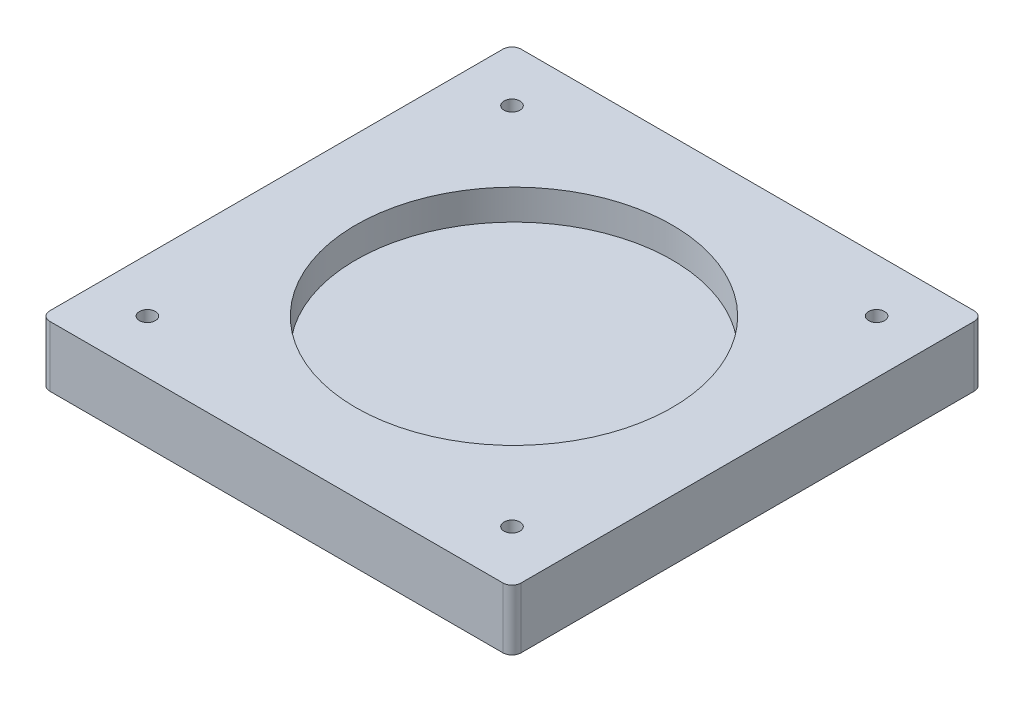
ISO-10303-21;
HEADER;
FILE_DESCRIPTION(('STEP AP214'),'2;1');
FILE_NAME('part.step','',(''),(''),'','','');
FILE_SCHEMA(('AUTOMOTIVE_DESIGN { 1 0 10303 214 1 1 1 1 }'));
ENDSEC;
DATA;
#1=APPLICATION_CONTEXT('core data for automotive mechanical design processes');
#2=APPLICATION_PROTOCOL_DEFINITION('international standard','automotive_design',2000,#1);
#3=PRODUCT_CONTEXT('',#1,'mechanical');
#4=PRODUCT('Part','Part','',(#3));
#5=PRODUCT_RELATED_PRODUCT_CATEGORY('part','',(#4));
#6=PRODUCT_DEFINITION_FORMATION('','',#4);
#7=PRODUCT_DEFINITION_CONTEXT('part definition',#1,'design');
#8=PRODUCT_DEFINITION('design','',#6,#7);
#9=PRODUCT_DEFINITION_SHAPE('','',#8);
#10=(LENGTH_UNIT() NAMED_UNIT(*) SI_UNIT(.MILLI.,.METRE.));
#11=(NAMED_UNIT(*) PLANE_ANGLE_UNIT() SI_UNIT($,.RADIAN.));
#12=(NAMED_UNIT(*) SI_UNIT($,.STERADIAN.) SOLID_ANGLE_UNIT());
#13=UNCERTAINTY_MEASURE_WITH_UNIT(LENGTH_MEASURE(1.E-05),#10,'distance_accuracy_value','');
#14=(GEOMETRIC_REPRESENTATION_CONTEXT(3) GLOBAL_UNCERTAINTY_ASSIGNED_CONTEXT((#13)) GLOBAL_UNIT_ASSIGNED_CONTEXT((#10,
#11,#12)) REPRESENTATION_CONTEXT('',''));
#15=CARTESIAN_POINT('',(0.,0.,0.));
#16=DIRECTION('',(0.,0.,1.));
#17=DIRECTION('',(1.,0.,0.));
#18=AXIS2_PLACEMENT_3D('',#15,#16,#17);
#19=CARTESIAN_POINT('',(74.4472356279509,20.,75.0981777127893));
#20=DIRECTION('',(0.,1.,0.));
#21=DIRECTION('',(0.,0.,1.));
#22=AXIS2_PLACEMENT_3D('',#19,#20,#21);
#23=PLANE('',#22);
#24=CARTESIAN_POINT('',(59.8231960346675,20.,60.474138119506));
#25=DIRECTION('',(0.,1.,0.));
#26=DIRECTION('',(0.,0.,1.));
#27=AXIS2_PLACEMENT_3D('',#24,#25,#26);
#28=CIRCLE('',#27,2.63764231323724);
#29=CARTESIAN_POINT('',(59.8231960346675,20.,63.1117804327432));
#30=VERTEX_POINT('',#29);
#31=EDGE_CURVE('E229',#30,#30,#28,.T.);
#32=ORIENTED_EDGE('',*,*,#31,.F.);
#33=EDGE_LOOP('',(#32));
#34=FACE_BOUND('',#33,.T.);
#35=CARTESIAN_POINT('',(-60.6043265364737,20.,-59.9533844516352));
#36=DIRECTION('',(0.,1.,0.));
#37=DIRECTION('',(0.,0.,1.));
#38=AXIS2_PLACEMENT_3D('',#35,#36,#37);
#39=CIRCLE('',#38,2.63764231323724);
#40=CARTESIAN_POINT('',(-60.6043265364737,20.,-57.315742138398));
#41=VERTEX_POINT('',#40);
#42=EDGE_CURVE('E213',#41,#41,#39,.T.);
#43=ORIENTED_EDGE('',*,*,#42,.F.);
#44=EDGE_LOOP('',(#43));
#45=FACE_BOUND('',#44,.T.);
#46=CARTESIAN_POINT('',(74.4472356279509,20.,75.0981777127893));
#47=DIRECTION('',(0.,1.,0.));
#48=DIRECTION('',(0.,0.,1.));
#49=AXIS2_PLACEMENT_3D('',#46,#47,#48);
#50=CIRCLE('',#49,3.01360271995386);
#51=CARTESIAN_POINT('',(74.4472356279509,20.,78.1117804327432));
#52=VERTEX_POINT('',#51);
#53=CARTESIAN_POINT('',(77.4608383479047,20.,75.0981777127893));
#54=VERTEX_POINT('',#53);
#55=EDGE_CURVE('E164',#52,#54,#50,.T.);
#56=ORIENTED_EDGE('',*,*,#55,.T.);
#57=DIRECTION('',(0.,0.,-1.));
#58=VECTOR('',#57,1.);
#59=CARTESIAN_POINT('',(77.4608383479047,20.,75.0981777127893));
#60=LINE('',#59,#58);
#61=CARTESIAN_POINT('',(77.4608383479047,20.,-74.5774240449186));
#62=VERTEX_POINT('',#61);
#63=EDGE_CURVE('E100',#54,#62,#60,.T.);
#64=ORIENTED_EDGE('',*,*,#63,.T.);
#65=CARTESIAN_POINT('',(74.4472356279509,20.,-74.5774240449186));
#66=DIRECTION('',(0.,1.,0.));
#67=DIRECTION('',(0.,0.,1.));
#68=AXIS2_PLACEMENT_3D('',#65,#66,#67);
#69=CIRCLE('',#68,3.01360271995387);
#70=CARTESIAN_POINT('',(74.4472356279509,20.,-77.5910267648724));
#71=VERTEX_POINT('',#70);
#72=EDGE_CURVE('E185',#62,#71,#69,.T.);
#73=ORIENTED_EDGE('',*,*,#72,.T.);
#74=DIRECTION('',(-1.,0.,0.));
#75=VECTOR('',#74,1.);
#76=CARTESIAN_POINT('',(74.4472356279509,20.,-77.5910267648724));
#77=LINE('',#76,#75);
#78=CARTESIAN_POINT('',(-75.228366129757,20.,-77.5910267648724));
#79=VERTEX_POINT('',#78);
#80=EDGE_CURVE('E199',#71,#79,#77,.T.);
#81=ORIENTED_EDGE('',*,*,#80,.T.);
#82=CARTESIAN_POINT('',(-75.228366129757,20.,-74.5774240449186));
#83=DIRECTION('',(0.,1.,0.));
#84=DIRECTION('',(0.,0.,1.));
#85=AXIS2_PLACEMENT_3D('',#82,#83,#84);
#86=CIRCLE('',#85,3.01360271995386);
#87=CARTESIAN_POINT('',(-78.2419688497109,20.,-74.5774240449186));
#88=VERTEX_POINT('',#87);
#89=EDGE_CURVE('E119',#79,#88,#86,.T.);
#90=ORIENTED_EDGE('',*,*,#89,.T.);
#91=DIRECTION('',(0.,0.,1.));
#92=VECTOR('',#91,1.);
#93=CARTESIAN_POINT('',(-78.2419688497109,20.,-74.5774240449186));
#94=LINE('',#93,#92);
#95=CARTESIAN_POINT('',(-78.2419688497109,20.,75.0981777127893));
#96=VERTEX_POINT('',#95);
#97=EDGE_CURVE('E113',#88,#96,#94,.T.);
#98=ORIENTED_EDGE('',*,*,#97,.T.);
#99=CARTESIAN_POINT('',(-75.228366129757,20.,75.0981777127893));
#100=DIRECTION('',(0.,1.,0.));
#101=DIRECTION('',(0.,0.,1.));
#102=AXIS2_PLACEMENT_3D('',#99,#100,#101);
#103=CIRCLE('',#102,3.01360271995386);
#104=CARTESIAN_POINT('',(-75.228366129757,20.,78.1117804327432));
#105=VERTEX_POINT('',#104);
#106=EDGE_CURVE('E117',#96,#105,#103,.T.);
#107=ORIENTED_EDGE('',*,*,#106,.T.);
#108=DIRECTION('',(1.,0.,0.));
#109=VECTOR('',#108,1.);
#110=CARTESIAN_POINT('',(-75.228366129757,20.,78.1117804327432));
#111=LINE('',#110,#109);
#112=EDGE_CURVE('E57',#105,#52,#111,.T.);
#113=ORIENTED_EDGE('',*,*,#112,.T.);
#114=EDGE_LOOP('',(#56,#64,#73,#81,#90,#98,#107,#113));
#115=FACE_BOUND('',#114,.T.);
#116=CARTESIAN_POINT('',(-60.6043265364737,20.,60.474138119506));
#117=DIRECTION('',(0.,1.,0.));
#118=DIRECTION('',(0.,0.,1.));
#119=AXIS2_PLACEMENT_3D('',#116,#117,#118);
#120=CIRCLE('',#119,2.63764231323724);
#121=CARTESIAN_POINT('',(-60.6043265364737,20.,63.1117804327432));
#122=VERTEX_POINT('',#121);
#123=EDGE_CURVE('E146',#122,#122,#120,.T.);
#124=ORIENTED_EDGE('',*,*,#123,.F.);
#125=EDGE_LOOP('',(#124));
#126=FACE_BOUND('',#125,.T.);
#127=CARTESIAN_POINT('',(59.8231960346675,20.,-59.9533844516352));
#128=DIRECTION('',(0.,1.,0.));
#129=DIRECTION('',(0.,0.,1.));
#130=AXIS2_PLACEMENT_3D('',#127,#128,#129);
#131=CIRCLE('',#130,2.63764231323722);
#132=CARTESIAN_POINT('',(59.8231960346675,20.,-57.315742138398));
#133=VERTEX_POINT('',#132);
#134=EDGE_CURVE('E221',#133,#133,#131,.T.);
#135=ORIENTED_EDGE('',*,*,#134,.F.);
#136=EDGE_LOOP('',(#135));
#137=FACE_BOUND('',#136,.T.);
#138=CARTESIAN_POINT('',(0.,20.,0.));
#139=DIRECTION('',(0.,1.,0.));
#140=DIRECTION('',(0.,0.,1.));
#141=AXIS2_PLACEMENT_3D('',#138,#139,#140);
#142=CIRCLE('',#141,52.25);
#143=CARTESIAN_POINT('',(0.,20.,52.25));
#144=VERTEX_POINT('',#143);
#145=EDGE_CURVE('E241',#144,#144,#142,.T.);
#146=ORIENTED_EDGE('',*,*,#145,.F.);
#147=EDGE_LOOP('',(#146));
#148=FACE_BOUND('',#147,.T.);
#149=ADVANCED_FACE('F39',(#34,#45,#115,#126,#137,#148),#23,.T.);
#150=CARTESIAN_POINT('',(74.4472356279509,0.,75.0981777127893));
#151=DIRECTION('',(0.,1.,0.));
#152=DIRECTION('',(0.,0.,1.));
#153=AXIS2_PLACEMENT_3D('',#150,#151,#152);
#154=PLANE('',#153);
#155=CARTESIAN_POINT('',(74.4472356279509,0.,75.0981777127893));
#156=DIRECTION('',(0.,1.,0.));
#157=DIRECTION('',(0.,0.,1.));
#158=AXIS2_PLACEMENT_3D('',#155,#156,#157);
#159=CIRCLE('',#158,3.01360271995386);
#160=CARTESIAN_POINT('',(74.4472356279509,0.,78.1117804327432));
#161=VERTEX_POINT('',#160);
#162=CARTESIAN_POINT('',(77.4608383479047,0.,75.0981777127893));
#163=VERTEX_POINT('',#162);
#164=EDGE_CURVE('E141',#161,#163,#159,.T.);
#165=ORIENTED_EDGE('',*,*,#164,.F.);
#166=DIRECTION('',(1.,0.,0.));
#167=VECTOR('',#166,1.);
#168=CARTESIAN_POINT('',(-75.228366129757,0.,78.1117804327432));
#169=LINE('',#168,#167);
#170=CARTESIAN_POINT('',(-75.228366129757,0.,78.1117804327432));
#171=VERTEX_POINT('',#170);
#172=EDGE_CURVE('E92',#171,#161,#169,.T.);
#173=ORIENTED_EDGE('',*,*,#172,.F.);
#174=CARTESIAN_POINT('',(-75.228366129757,0.,75.0981777127893));
#175=DIRECTION('',(0.,1.,0.));
#176=DIRECTION('',(0.,0.,1.));
#177=AXIS2_PLACEMENT_3D('',#174,#175,#176);
#178=CIRCLE('',#177,3.01360271995386);
#179=CARTESIAN_POINT('',(-78.2419688497109,0.,75.0981777127893));
#180=VERTEX_POINT('',#179);
#181=EDGE_CURVE('E86',#180,#171,#178,.T.);
#182=ORIENTED_EDGE('',*,*,#181,.F.);
#183=DIRECTION('',(0.,0.,1.));
#184=VECTOR('',#183,1.);
#185=CARTESIAN_POINT('',(-78.2419688497109,0.,-74.5774240449186));
#186=LINE('',#185,#184);
#187=CARTESIAN_POINT('',(-78.2419688497109,0.,-74.5774240449186));
#188=VERTEX_POINT('',#187);
#189=EDGE_CURVE('E128',#188,#180,#186,.T.);
#190=ORIENTED_EDGE('',*,*,#189,.F.);
#191=CARTESIAN_POINT('',(-75.228366129757,0.,-74.5774240449186));
#192=DIRECTION('',(0.,1.,0.));
#193=DIRECTION('',(0.,0.,1.));
#194=AXIS2_PLACEMENT_3D('',#191,#192,#193);
#195=CIRCLE('',#194,3.01360271995386);
#196=CARTESIAN_POINT('',(-75.228366129757,0.,-77.5910267648724));
#197=VERTEX_POINT('',#196);
#198=EDGE_CURVE('E155',#197,#188,#195,.T.);
#199=ORIENTED_EDGE('',*,*,#198,.F.);
#200=DIRECTION('',(-1.,0.,0.));
#201=VECTOR('',#200,1.);
#202=CARTESIAN_POINT('',(74.4472356279509,0.,-77.5910267648724));
#203=LINE('',#202,#201);
#204=CARTESIAN_POINT('',(74.4472356279509,0.,-77.5910267648724));
#205=VERTEX_POINT('',#204);
#206=EDGE_CURVE('E152',#205,#197,#203,.T.);
#207=ORIENTED_EDGE('',*,*,#206,.F.);
#208=CARTESIAN_POINT('',(74.4472356279509,0.,-74.5774240449186));
#209=DIRECTION('',(0.,1.,0.));
#210=DIRECTION('',(0.,0.,1.));
#211=AXIS2_PLACEMENT_3D('',#208,#209,#210);
#212=CIRCLE('',#211,3.01360271995387);
#213=CARTESIAN_POINT('',(77.4608383479047,0.,-74.5774240449186));
#214=VERTEX_POINT('',#213);
#215=EDGE_CURVE('E149',#214,#205,#212,.T.);
#216=ORIENTED_EDGE('',*,*,#215,.F.);
#217=DIRECTION('',(0.,0.,-1.));
#218=VECTOR('',#217,1.);
#219=CARTESIAN_POINT('',(77.4608383479047,0.,75.0981777127893));
#220=LINE('',#219,#218);
#221=EDGE_CURVE('E145',#163,#214,#220,.T.);
#222=ORIENTED_EDGE('',*,*,#221,.F.);
#223=EDGE_LOOP('',(#165,#173,#182,#190,#199,#207,#216,#222));
#224=FACE_BOUND('',#223,.T.);
#225=CARTESIAN_POINT('',(-60.6043265364737,0.,60.474138119506));
#226=DIRECTION('',(0.,1.,0.));
#227=DIRECTION('',(0.,0.,1.));
#228=AXIS2_PLACEMENT_3D('',#225,#226,#227);
#229=CIRCLE('',#228,2.63764231323724);
#230=CARTESIAN_POINT('',(-60.6043265364737,0.,63.1117804327432));
#231=VERTEX_POINT('',#230);
#232=EDGE_CURVE('E209',#231,#231,#229,.T.);
#233=ORIENTED_EDGE('',*,*,#232,.T.);
#234=EDGE_LOOP('',(#233));
#235=FACE_BOUND('',#234,.T.);
#236=CARTESIAN_POINT('',(-60.6043265364737,0.,-59.9533844516352));
#237=DIRECTION('',(0.,1.,0.));
#238=DIRECTION('',(0.,0.,1.));
#239=AXIS2_PLACEMENT_3D('',#236,#237,#238);
#240=CIRCLE('',#239,2.63764231323724);
#241=CARTESIAN_POINT('',(-60.6043265364737,0.,-57.315742138398));
#242=VERTEX_POINT('',#241);
#243=EDGE_CURVE('E217',#242,#242,#240,.T.);
#244=ORIENTED_EDGE('',*,*,#243,.T.);
#245=EDGE_LOOP('',(#244));
#246=FACE_BOUND('',#245,.T.);
#247=CARTESIAN_POINT('',(59.8231960346675,0.,-59.9533844516352));
#248=DIRECTION('',(0.,1.,0.));
#249=DIRECTION('',(0.,0.,1.));
#250=AXIS2_PLACEMENT_3D('',#247,#248,#249);
#251=CIRCLE('',#250,2.63764231323722);
#252=CARTESIAN_POINT('',(59.8231960346675,0.,-57.315742138398));
#253=VERTEX_POINT('',#252);
#254=EDGE_CURVE('E225',#253,#253,#251,.T.);
#255=ORIENTED_EDGE('',*,*,#254,.T.);
#256=EDGE_LOOP('',(#255));
#257=FACE_BOUND('',#256,.T.);
#258=CARTESIAN_POINT('',(59.8231960346675,0.,60.474138119506));
#259=DIRECTION('',(0.,1.,0.));
#260=DIRECTION('',(0.,0.,1.));
#261=AXIS2_PLACEMENT_3D('',#258,#259,#260);
#262=CIRCLE('',#261,2.63764231323724);
#263=CARTESIAN_POINT('',(59.8231960346675,0.,63.1117804327432));
#264=VERTEX_POINT('',#263);
#265=EDGE_CURVE('E233',#264,#264,#262,.T.);
#266=ORIENTED_EDGE('',*,*,#265,.T.);
#267=EDGE_LOOP('',(#266));
#268=FACE_BOUND('',#267,.T.);
#269=ADVANCED_FACE('F189',(#224,#235,#246,#257,#268),#154,.F.);
#270=CARTESIAN_POINT('',(74.4472356279509,20.,75.0981777127893));
#271=DIRECTION('',(0.,-1.,0.));
#272=DIRECTION('',(0.,0.,-1.));
#273=AXIS2_PLACEMENT_3D('',#270,#271,#272);
#274=CYLINDRICAL_SURFACE('',#273,3.01360271995386);
#275=ORIENTED_EDGE('',*,*,#164,.T.);
#276=DIRECTION('',(0.,-1.,0.));
#277=VECTOR('',#276,1.);
#278=CARTESIAN_POINT('',(77.4608383479047,20.,75.0981777127893));
#279=LINE('',#278,#277);
#280=EDGE_CURVE('E11',#54,#163,#279,.T.);
#281=ORIENTED_EDGE('',*,*,#280,.F.);
#282=ORIENTED_EDGE('',*,*,#55,.F.);
#283=DIRECTION('',(0.,-1.,0.));
#284=VECTOR('',#283,1.);
#285=CARTESIAN_POINT('',(74.4472356279509,20.,78.1117804327432));
#286=LINE('',#285,#284);
#287=EDGE_CURVE('E137',#52,#161,#286,.T.);
#288=ORIENTED_EDGE('',*,*,#287,.T.);
#289=EDGE_LOOP('',(#275,#281,#282,#288));
#290=FACE_BOUND('',#289,.T.);
#291=ADVANCED_FACE('F41',(#290),#274,.T.);
#292=CARTESIAN_POINT('',(77.4608383479047,20.,75.0981777127893));
#293=DIRECTION('',(-1.,0.,0.));
#294=DIRECTION('',(0.,0.,1.));
#295=AXIS2_PLACEMENT_3D('',#292,#293,#294);
#296=PLANE('',#295);
#297=ORIENTED_EDGE('',*,*,#221,.T.);
#298=DIRECTION('',(0.,-1.,0.));
#299=VECTOR('',#298,1.);
#300=CARTESIAN_POINT('',(77.4608383479047,20.,-74.5774240449186));
#301=LINE('',#300,#299);
#302=EDGE_CURVE('E49',#62,#214,#301,.T.);
#303=ORIENTED_EDGE('',*,*,#302,.F.);
#304=ORIENTED_EDGE('',*,*,#63,.F.);
#305=ORIENTED_EDGE('',*,*,#280,.T.);
#306=EDGE_LOOP('',(#297,#303,#304,#305));
#307=FACE_BOUND('',#306,.T.);
#308=ADVANCED_FACE('F283',(#307),#296,.F.);
#309=CARTESIAN_POINT('',(74.4472356279509,20.,-74.5774240449186));
#310=DIRECTION('',(0.,-1.,0.));
#311=DIRECTION('',(0.,0.,-1.));
#312=AXIS2_PLACEMENT_3D('',#309,#310,#311);
#313=CYLINDRICAL_SURFACE('',#312,3.01360271995387);
#314=ORIENTED_EDGE('',*,*,#215,.T.);
#315=DIRECTION('',(0.,-1.,0.));
#316=VECTOR('',#315,1.);
#317=CARTESIAN_POINT('',(74.4472356279509,20.,-77.5910267648724));
#318=LINE('',#317,#316);
#319=EDGE_CURVE('E175',#71,#205,#318,.T.);
#320=ORIENTED_EDGE('',*,*,#319,.F.);
#321=ORIENTED_EDGE('',*,*,#72,.F.);
#322=ORIENTED_EDGE('',*,*,#302,.T.);
#323=EDGE_LOOP('',(#314,#320,#321,#322));
#324=FACE_BOUND('',#323,.T.);
#325=ADVANCED_FACE('F183',(#324),#313,.T.);
#326=CARTESIAN_POINT('',(74.4472356279509,20.,-77.5910267648724));
#327=DIRECTION('',(0.,0.,1.));
#328=DIRECTION('',(1.,0.,0.));
#329=AXIS2_PLACEMENT_3D('',#326,#327,#328);
#330=PLANE('',#329);
#331=ORIENTED_EDGE('',*,*,#206,.T.);
#332=DIRECTION('',(0.,-1.,0.));
#333=VECTOR('',#332,1.);
#334=CARTESIAN_POINT('',(-75.228366129757,20.,-77.5910267648724));
#335=LINE('',#334,#333);
#336=EDGE_CURVE('E171',#79,#197,#335,.T.);
#337=ORIENTED_EDGE('',*,*,#336,.F.);
#338=ORIENTED_EDGE('',*,*,#80,.F.);
#339=ORIENTED_EDGE('',*,*,#319,.T.);
#340=EDGE_LOOP('',(#331,#337,#338,#339));
#341=FACE_BOUND('',#340,.T.);
#342=ADVANCED_FACE('F194',(#341),#330,.F.);
#343=CARTESIAN_POINT('',(-75.228366129757,20.,-74.5774240449186));
#344=DIRECTION('',(0.,-1.,0.));
#345=DIRECTION('',(0.,0.,-1.));
#346=AXIS2_PLACEMENT_3D('',#343,#344,#345);
#347=CYLINDRICAL_SURFACE('',#346,3.01360271995386);
#348=ORIENTED_EDGE('',*,*,#198,.T.);
#349=DIRECTION('',(0.,-1.,0.));
#350=VECTOR('',#349,1.);
#351=CARTESIAN_POINT('',(-78.2419688497109,20.,-74.5774240449186));
#352=LINE('',#351,#350);
#353=EDGE_CURVE('E130',#88,#188,#352,.T.);
#354=ORIENTED_EDGE('',*,*,#353,.F.);
#355=ORIENTED_EDGE('',*,*,#89,.F.);
#356=ORIENTED_EDGE('',*,*,#336,.T.);
#357=EDGE_LOOP('',(#348,#354,#355,#356));
#358=FACE_BOUND('',#357,.T.);
#359=ADVANCED_FACE('F197',(#358),#347,.T.);
#360=CARTESIAN_POINT('',(-78.2419688497109,20.,-74.5774240449186));
#361=DIRECTION('',(1.,0.,0.));
#362=DIRECTION('',(0.,0.,-1.));
#363=AXIS2_PLACEMENT_3D('',#360,#361,#362);
#364=PLANE('',#363);
#365=ORIENTED_EDGE('',*,*,#189,.T.);
#366=DIRECTION('',(0.,-1.,0.));
#367=VECTOR('',#366,1.);
#368=CARTESIAN_POINT('',(-78.2419688497109,20.,75.0981777127893));
#369=LINE('',#368,#367);
#370=EDGE_CURVE('E125',#96,#180,#369,.T.);
#371=ORIENTED_EDGE('',*,*,#370,.F.);
#372=ORIENTED_EDGE('',*,*,#97,.F.);
#373=ORIENTED_EDGE('',*,*,#353,.T.);
#374=EDGE_LOOP('',(#365,#371,#372,#373));
#375=FACE_BOUND('',#374,.T.);
#376=ADVANCED_FACE('F126',(#375),#364,.F.);
#377=CARTESIAN_POINT('',(-75.228366129757,20.,75.0981777127893));
#378=DIRECTION('',(0.,-1.,0.));
#379=DIRECTION('',(0.,0.,-1.));
#380=AXIS2_PLACEMENT_3D('',#377,#378,#379);
#381=CYLINDRICAL_SURFACE('',#380,3.01360271995386);
#382=ORIENTED_EDGE('',*,*,#181,.T.);
#383=DIRECTION('',(0.,-1.,0.));
#384=VECTOR('',#383,1.);
#385=CARTESIAN_POINT('',(-75.228366129757,20.,78.1117804327432));
#386=LINE('',#385,#384);
#387=EDGE_CURVE('E131',#105,#171,#386,.T.);
#388=ORIENTED_EDGE('',*,*,#387,.F.);
#389=ORIENTED_EDGE('',*,*,#106,.F.);
#390=ORIENTED_EDGE('',*,*,#370,.T.);
#391=EDGE_LOOP('',(#382,#388,#389,#390));
#392=FACE_BOUND('',#391,.T.);
#393=ADVANCED_FACE('F133',(#392),#381,.T.);
#394=CARTESIAN_POINT('',(-75.228366129757,20.,78.1117804327432));
#395=DIRECTION('',(0.,0.,-1.));
#396=DIRECTION('',(-1.,0.,0.));
#397=AXIS2_PLACEMENT_3D('',#394,#395,#396);
#398=PLANE('',#397);
#399=ORIENTED_EDGE('',*,*,#172,.T.);
#400=ORIENTED_EDGE('',*,*,#287,.F.);
#401=ORIENTED_EDGE('',*,*,#112,.F.);
#402=ORIENTED_EDGE('',*,*,#387,.T.);
#403=EDGE_LOOP('',(#399,#400,#401,#402));
#404=FACE_BOUND('',#403,.T.);
#405=ADVANCED_FACE('F271',(#404),#398,.F.);
#406=CARTESIAN_POINT('',(-60.6043265364737,20.,60.474138119506));
#407=DIRECTION('',(0.,-1.,0.));
#408=DIRECTION('',(0.,0.,-1.));
#409=AXIS2_PLACEMENT_3D('',#406,#407,#408);
#410=CYLINDRICAL_SURFACE('',#409,2.63764231323724);
#411=ORIENTED_EDGE('',*,*,#123,.T.);
#412=EDGE_LOOP('',(#411));
#413=FACE_BOUND('',#412,.T.);
#414=ORIENTED_EDGE('',*,*,#232,.F.);
#415=EDGE_LOOP('',(#414));
#416=FACE_BOUND('',#415,.T.);
#417=ADVANCED_FACE('F268',(#413,#416),#410,.F.);
#418=CARTESIAN_POINT('',(-60.6043265364737,20.,-59.9533844516352));
#419=DIRECTION('',(0.,-1.,0.));
#420=DIRECTION('',(0.,0.,-1.));
#421=AXIS2_PLACEMENT_3D('',#418,#419,#420);
#422=CYLINDRICAL_SURFACE('',#421,2.63764231323724);
#423=ORIENTED_EDGE('',*,*,#42,.T.);
#424=EDGE_LOOP('',(#423));
#425=FACE_BOUND('',#424,.T.);
#426=ORIENTED_EDGE('',*,*,#243,.F.);
#427=EDGE_LOOP('',(#426));
#428=FACE_BOUND('',#427,.T.);
#429=ADVANCED_FACE('F326',(#425,#428),#422,.F.);
#430=CARTESIAN_POINT('',(59.8231960346675,20.,-59.9533844516352));
#431=DIRECTION('',(0.,-1.,0.));
#432=DIRECTION('',(0.,0.,-1.));
#433=AXIS2_PLACEMENT_3D('',#430,#431,#432);
#434=CYLINDRICAL_SURFACE('',#433,2.63764231323722);
#435=ORIENTED_EDGE('',*,*,#134,.T.);
#436=EDGE_LOOP('',(#435));
#437=FACE_BOUND('',#436,.T.);
#438=ORIENTED_EDGE('',*,*,#254,.F.);
#439=EDGE_LOOP('',(#438));
#440=FACE_BOUND('',#439,.T.);
#441=ADVANCED_FACE('F318',(#437,#440),#434,.F.);
#442=CARTESIAN_POINT('',(59.8231960346675,20.,60.474138119506));
#443=DIRECTION('',(0.,-1.,0.));
#444=DIRECTION('',(0.,0.,-1.));
#445=AXIS2_PLACEMENT_3D('',#442,#443,#444);
#446=CYLINDRICAL_SURFACE('',#445,2.63764231323724);
#447=ORIENTED_EDGE('',*,*,#31,.T.);
#448=EDGE_LOOP('',(#447));
#449=FACE_BOUND('',#448,.T.);
#450=ORIENTED_EDGE('',*,*,#265,.F.);
#451=EDGE_LOOP('',(#450));
#452=FACE_BOUND('',#451,.T.);
#453=ADVANCED_FACE('F254',(#449,#452),#446,.F.);
#454=CARTESIAN_POINT('',(0.,10.,0.));
#455=DIRECTION('',(0.,1.,0.));
#456=DIRECTION('',(0.,0.,1.));
#457=AXIS2_PLACEMENT_3D('',#454,#455,#456);
#458=CYLINDRICAL_SURFACE('',#457,52.25);
#459=CARTESIAN_POINT('',(0.,10.,0.));
#460=DIRECTION('',(0.,1.,0.));
#461=DIRECTION('',(0.,0.,1.));
#462=AXIS2_PLACEMENT_3D('',#459,#460,#461);
#463=CIRCLE('',#462,52.25);
#464=CARTESIAN_POINT('',(0.,10.,52.25));
#465=VERTEX_POINT('',#464);
#466=EDGE_CURVE('E237',#465,#465,#463,.T.);
#467=ORIENTED_EDGE('',*,*,#466,.F.);
#468=EDGE_LOOP('',(#467));
#469=FACE_BOUND('',#468,.T.);
#470=ORIENTED_EDGE('',*,*,#145,.T.);
#471=EDGE_LOOP('',(#470));
#472=FACE_BOUND('',#471,.T.);
#473=ADVANCED_FACE('F251',(#469,#472),#458,.F.);
#474=CARTESIAN_POINT('',(0.,10.,0.));
#475=DIRECTION('',(0.,-1.,0.));
#476=DIRECTION('',(0.,0.,-1.));
#477=AXIS2_PLACEMENT_3D('',#474,#475,#476);
#478=PLANE('',#477);
#479=ORIENTED_EDGE('',*,*,#466,.T.);
#480=EDGE_LOOP('',(#479));
#481=FACE_BOUND('',#480,.T.);
#482=ADVANCED_FACE('F249',(#481),#478,.F.);
#483=CLOSED_SHELL('',(#149,#269,#291,#308,#325,#342,#359,#376,#393,#405,#417,#429,#441,#453,
#473,#482));
#484=MANIFOLD_SOLID_BREP('B2',#483);
#485=ADVANCED_BREP_SHAPE_REPRESENTATION('',(#18,#484),#14);
#486=SHAPE_DEFINITION_REPRESENTATION(#9,#485);
ENDSEC;
END-ISO-10303-21;
